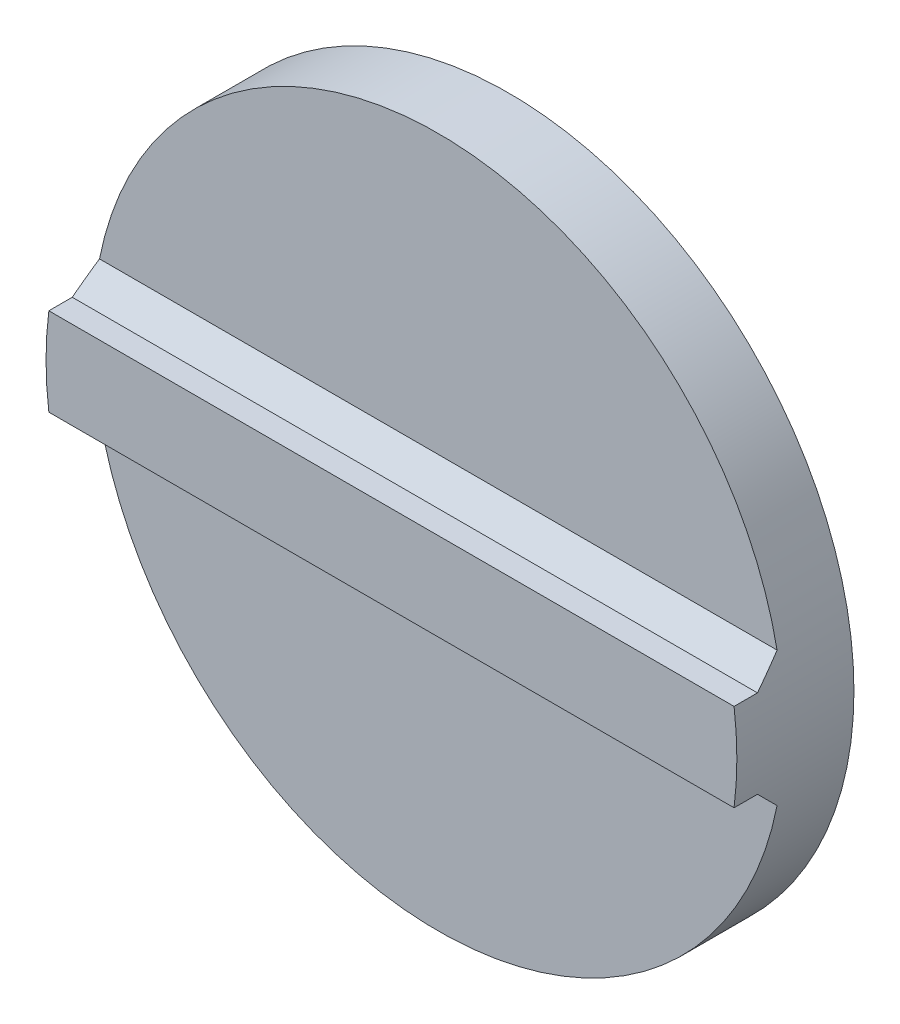
ISO-10303-21;
HEADER;
FILE_DESCRIPTION(('STEP AP214'),'2;1');
FILE_NAME('part.step','',(''),(''),'','','');
FILE_SCHEMA(('AUTOMOTIVE_DESIGN { 1 0 10303 214 1 1 1 1 }'));
ENDSEC;
DATA;
#1=APPLICATION_CONTEXT('core data for automotive mechanical design processes');
#2=APPLICATION_PROTOCOL_DEFINITION('international standard','automotive_design',2000,#1);
#3=PRODUCT_CONTEXT('',#1,'mechanical');
#4=PRODUCT('Part','Part','',(#3));
#5=PRODUCT_RELATED_PRODUCT_CATEGORY('part','',(#4));
#6=PRODUCT_DEFINITION_FORMATION('','',#4);
#7=PRODUCT_DEFINITION_CONTEXT('part definition',#1,'design');
#8=PRODUCT_DEFINITION('design','',#6,#7);
#9=PRODUCT_DEFINITION_SHAPE('','',#8);
#10=(LENGTH_UNIT() NAMED_UNIT(*) SI_UNIT(.MILLI.,.METRE.));
#11=(NAMED_UNIT(*) PLANE_ANGLE_UNIT() SI_UNIT($,.RADIAN.));
#12=(NAMED_UNIT(*) SI_UNIT($,.STERADIAN.) SOLID_ANGLE_UNIT());
#13=UNCERTAINTY_MEASURE_WITH_UNIT(LENGTH_MEASURE(1.E-05),#10,'distance_accuracy_value','');
#14=(GEOMETRIC_REPRESENTATION_CONTEXT(3) GLOBAL_UNCERTAINTY_ASSIGNED_CONTEXT((#13)) GLOBAL_UNIT_ASSIGNED_CONTEXT((#10,
#11,#12)) REPRESENTATION_CONTEXT('',''));
#15=CARTESIAN_POINT('',(0.,0.,0.));
#16=DIRECTION('',(0.,0.,1.));
#17=DIRECTION('',(1.,0.,0.));
#18=AXIS2_PLACEMENT_3D('',#15,#16,#17);
#19=CARTESIAN_POINT('',(0.,0.,1.2));
#20=DIRECTION('',(0.,0.,1.));
#21=DIRECTION('',(1.,0.,0.));
#22=AXIS2_PLACEMENT_3D('',#19,#20,#21);
#23=PLANE('',#22);
#24=CARTESIAN_POINT('',(0.,0.,1.2));
#25=DIRECTION('',(0.,0.,1.));
#26=DIRECTION('',(1.,0.,0.));
#27=AXIS2_PLACEMENT_3D('',#24,#25,#26);
#28=CIRCLE('',#27,5.9);
#29=CARTESIAN_POINT('',(-5.78683851511341,-1.15,1.2));
#30=VERTEX_POINT('',#29);
#31=CARTESIAN_POINT('',(5.78683851511341,-1.15,1.2));
#32=VERTEX_POINT('',#31);
#33=EDGE_CURVE('E132',#30,#32,#28,.T.);
#34=ORIENTED_EDGE('',*,*,#33,.T.);
#35=DIRECTION('',(-1.,0.,0.));
#36=VECTOR('',#35,1.);
#37=CARTESIAN_POINT('',(0.,-1.15,1.2));
#38=LINE('',#37,#36);
#39=EDGE_CURVE('E145',#32,#30,#38,.T.);
#40=ORIENTED_EDGE('',*,*,#39,.T.);
#41=EDGE_LOOP('',(#34,#40));
#42=FACE_BOUND('',#41,.T.);
#43=ADVANCED_FACE('F47',(#42),#23,.T.);
#44=CARTESIAN_POINT('',(0.,0.,1.2));
#45=DIRECTION('',(0.,0.,-1.));
#46=DIRECTION('',(-1.,0.,0.));
#47=AXIS2_PLACEMENT_3D('',#44,#45,#46);
#48=CYLINDRICAL_SURFACE('',#47,5.9);
#49=CARTESIAN_POINT('',(5.78683851511341,1.15,1.2));
#50=VERTEX_POINT('',#49);
#51=CARTESIAN_POINT('',(-5.78683851511341,1.15,1.2));
#52=VERTEX_POINT('',#51);
#53=EDGE_CURVE('E138',#50,#52,#28,.T.);
#54=ORIENTED_EDGE('',*,*,#53,.F.);
#55=CARTESIAN_POINT('',(0.,0.,2.35000000000001));
#56=DIRECTION('',(0.,-0.707106781186549,-0.707106781186546));
#57=DIRECTION('',(0.,0.707106781186546,-0.707106781186549));
#58=AXIS2_PLACEMENT_3D('',#55,#56,#57);
#59=ELLIPSE('',#58,8.34386001800128,5.9);
#60=CARTESIAN_POINT('',(5.85213636204762,0.750000000000005,1.6));
#61=VERTEX_POINT('',#60);
#62=EDGE_CURVE('E11',#50,#61,#59,.T.);
#63=ORIENTED_EDGE('',*,*,#62,.T.);
#64=DIRECTION('',(0.,0.,-1.));
#65=VECTOR('',#64,1.);
#66=CARTESIAN_POINT('',(5.85213636204762,0.750000000000005,2.));
#67=LINE('',#66,#65);
#68=CARTESIAN_POINT('',(5.85213636204762,0.750000000000005,2.));
#69=VERTEX_POINT('',#68);
#70=EDGE_CURVE('E105',#69,#61,#67,.T.);
#71=ORIENTED_EDGE('',*,*,#70,.F.);
#72=CARTESIAN_POINT('',(0.,0.,2.));
#73=DIRECTION('',(0.,0.,1.));
#74=DIRECTION('',(1.,0.,0.));
#75=AXIS2_PLACEMENT_3D('',#72,#73,#74);
#76=CIRCLE('',#75,5.9);
#77=CARTESIAN_POINT('',(5.85213636204763,-0.750000000000002,2.));
#78=VERTEX_POINT('',#77);
#79=EDGE_CURVE('E112',#78,#69,#76,.T.);
#80=ORIENTED_EDGE('',*,*,#79,.F.);
#81=DIRECTION('',(0.,0.,-1.));
#82=VECTOR('',#81,1.);
#83=CARTESIAN_POINT('',(5.85213636204763,-0.750000000000002,2.));
#84=LINE('',#83,#82);
#85=CARTESIAN_POINT('',(5.85213636204763,-0.750000000000002,1.6));
#86=VERTEX_POINT('',#85);
#87=EDGE_CURVE('E173',#78,#86,#84,.T.);
#88=ORIENTED_EDGE('',*,*,#87,.T.);
#89=CARTESIAN_POINT('',(0.,0.,2.35000000000001));
#90=DIRECTION('',(0.,0.707106781186549,-0.707106781186546));
#91=DIRECTION('',(0.,-0.707106781186546,-0.707106781186549));
#92=AXIS2_PLACEMENT_3D('',#89,#90,#91);
#93=ELLIPSE('',#92,8.34386001800128,5.9);
#94=EDGE_CURVE('E153',#86,#32,#93,.T.);
#95=ORIENTED_EDGE('',*,*,#94,.T.);
#96=ORIENTED_EDGE('',*,*,#33,.F.);
#97=CARTESIAN_POINT('',(0.,0.,2.35000000000001));
#98=DIRECTION('',(0.,0.707106781186549,-0.707106781186546));
#99=DIRECTION('',(0.,-0.707106781186546,-0.707106781186549));
#100=AXIS2_PLACEMENT_3D('',#97,#98,#99);
#101=ELLIPSE('',#100,8.34386001800128,5.9);
#102=CARTESIAN_POINT('',(-5.85213636204763,-0.750000000000002,1.6));
#103=VERTEX_POINT('',#102);
#104=EDGE_CURVE('E156',#30,#103,#101,.T.);
#105=ORIENTED_EDGE('',*,*,#104,.T.);
#106=DIRECTION('',(0.,0.,-1.));
#107=VECTOR('',#106,1.);
#108=CARTESIAN_POINT('',(-5.85213636204763,-0.750000000000002,2.));
#109=LINE('',#108,#107);
#110=CARTESIAN_POINT('',(-5.85213636204763,-0.750000000000002,2.));
#111=VERTEX_POINT('',#110);
#112=EDGE_CURVE('E134',#111,#103,#109,.T.);
#113=ORIENTED_EDGE('',*,*,#112,.F.);
#114=CARTESIAN_POINT('',(0.,0.,2.));
#115=DIRECTION('',(0.,0.,1.));
#116=DIRECTION('',(1.,0.,0.));
#117=AXIS2_PLACEMENT_3D('',#114,#115,#116);
#118=CIRCLE('',#117,5.9);
#119=CARTESIAN_POINT('',(-5.85213636204763,0.749999999999998,2.));
#120=VERTEX_POINT('',#119);
#121=EDGE_CURVE('E111',#120,#111,#118,.T.);
#122=ORIENTED_EDGE('',*,*,#121,.F.);
#123=DIRECTION('',(0.,0.,-1.));
#124=VECTOR('',#123,1.);
#125=CARTESIAN_POINT('',(-5.85213636204763,0.749999999999998,2.));
#126=LINE('',#125,#124);
#127=CARTESIAN_POINT('',(-5.85213636204763,0.749999999999998,1.6));
#128=VERTEX_POINT('',#127);
#129=EDGE_CURVE('E107',#120,#128,#126,.T.);
#130=ORIENTED_EDGE('',*,*,#129,.T.);
#131=CARTESIAN_POINT('',(0.,0.,2.35000000000001));
#132=DIRECTION('',(0.,-0.707106781186549,-0.707106781186546));
#133=DIRECTION('',(0.,0.707106781186546,-0.707106781186549));
#134=AXIS2_PLACEMENT_3D('',#131,#132,#133);
#135=ELLIPSE('',#134,8.34386001800128,5.9);
#136=EDGE_CURVE('E57',#128,#52,#135,.T.);
#137=ORIENTED_EDGE('',*,*,#136,.T.);
#138=EDGE_LOOP('',(#54,#63,#71,#80,#88,#95,#96,#105,#113,#122,#130,#137));
#139=FACE_BOUND('',#138,.T.);
#140=CARTESIAN_POINT('',(0.,0.,0.));
#141=DIRECTION('',(0.,0.,1.));
#142=DIRECTION('',(1.,0.,0.));
#143=AXIS2_PLACEMENT_3D('',#140,#141,#142);
#144=CIRCLE('',#143,5.9);
#145=CARTESIAN_POINT('',(5.9,0.,0.));
#146=VERTEX_POINT('',#145);
#147=EDGE_CURVE('E127',#146,#146,#144,.T.);
#148=ORIENTED_EDGE('',*,*,#147,.T.);
#149=EDGE_LOOP('',(#148));
#150=FACE_BOUND('',#149,.T.);
#151=ADVANCED_FACE('F123',(#139,#150),#48,.T.);
#152=ORIENTED_EDGE('',*,*,#53,.T.);
#153=DIRECTION('',(1.,0.,0.));
#154=VECTOR('',#153,1.);
#155=CARTESIAN_POINT('',(0.,1.15,1.2));
#156=LINE('',#155,#154);
#157=EDGE_CURVE('E69',#52,#50,#156,.T.);
#158=ORIENTED_EDGE('',*,*,#157,.T.);
#159=EDGE_LOOP('',(#152,#158));
#160=FACE_BOUND('',#159,.T.);
#161=ADVANCED_FACE('F200',(#160),#23,.T.);
#162=CARTESIAN_POINT('',(0.,0.,0.));
#163=DIRECTION('',(0.,0.,1.));
#164=DIRECTION('',(1.,0.,0.));
#165=AXIS2_PLACEMENT_3D('',#162,#163,#164);
#166=PLANE('',#165);
#167=CARTESIAN_POINT('',(0.,0.,0.));
#168=DIRECTION('',(0.,0.,-1.));
#169=DIRECTION('',(-1.,0.,0.));
#170=AXIS2_PLACEMENT_3D('',#167,#168,#169);
#171=CIRCLE('',#170,1.5);
#172=CARTESIAN_POINT('',(-1.5,0.,0.));
#173=VERTEX_POINT('',#172);
#174=EDGE_CURVE('E181',#173,#173,#171,.T.);
#175=ORIENTED_EDGE('',*,*,#174,.F.);
#176=EDGE_LOOP('',(#175));
#177=FACE_BOUND('',#176,.T.);
#178=ORIENTED_EDGE('',*,*,#147,.F.);
#179=EDGE_LOOP('',(#178));
#180=FACE_BOUND('',#179,.T.);
#181=ADVANCED_FACE('F197',(#177,#180),#166,.F.);
#182=CARTESIAN_POINT('',(-5.85213636204763,0.749999999999998,2.));
#183=DIRECTION('',(0.,-1.,0.));
#184=DIRECTION('',(1.,0.,0.));
#185=AXIS2_PLACEMENT_3D('',#182,#183,#184);
#186=PLANE('',#185);
#187=ORIENTED_EDGE('',*,*,#70,.T.);
#188=DIRECTION('',(-1.,0.,0.));
#189=VECTOR('',#188,1.);
#190=CARTESIAN_POINT('',(-5.85213636204763,0.749999999999998,1.6));
#191=LINE('',#190,#189);
#192=EDGE_CURVE('E148',#61,#128,#191,.T.);
#193=ORIENTED_EDGE('',*,*,#192,.T.);
#194=ORIENTED_EDGE('',*,*,#129,.F.);
#195=DIRECTION('',(-1.,0.,0.));
#196=VECTOR('',#195,1.);
#197=CARTESIAN_POINT('',(-5.85213636204763,0.749999999999998,2.));
#198=LINE('',#197,#196);
#199=EDGE_CURVE('E100',#69,#120,#198,.T.);
#200=ORIENTED_EDGE('',*,*,#199,.F.);
#201=EDGE_LOOP('',(#187,#193,#194,#200));
#202=FACE_BOUND('',#201,.T.);
#203=ADVANCED_FACE('F102',(#202),#186,.F.);
#204=CARTESIAN_POINT('',(-5.85213636204763,-0.750000000000002,2.));
#205=DIRECTION('',(0.,1.,0.));
#206=DIRECTION('',(0.,0.,1.));
#207=AXIS2_PLACEMENT_3D('',#204,#205,#206);
#208=PLANE('',#207);
#209=ORIENTED_EDGE('',*,*,#112,.T.);
#210=DIRECTION('',(1.,0.,0.));
#211=VECTOR('',#210,1.);
#212=CARTESIAN_POINT('',(-5.85213636204763,-0.750000000000002,1.6));
#213=LINE('',#212,#211);
#214=EDGE_CURVE('E140',#103,#86,#213,.T.);
#215=ORIENTED_EDGE('',*,*,#214,.T.);
#216=ORIENTED_EDGE('',*,*,#87,.F.);
#217=DIRECTION('',(1.,0.,0.));
#218=VECTOR('',#217,1.);
#219=CARTESIAN_POINT('',(-5.85213636204763,-0.750000000000002,2.));
#220=LINE('',#219,#218);
#221=EDGE_CURVE('E117',#111,#78,#220,.T.);
#222=ORIENTED_EDGE('',*,*,#221,.F.);
#223=EDGE_LOOP('',(#209,#215,#216,#222));
#224=FACE_BOUND('',#223,.T.);
#225=ADVANCED_FACE('F171',(#224),#208,.F.);
#226=CARTESIAN_POINT('',(0.,0.,2.));
#227=DIRECTION('',(0.,0.,1.));
#228=DIRECTION('',(1.,0.,0.));
#229=AXIS2_PLACEMENT_3D('',#226,#227,#228);
#230=PLANE('',#229);
#231=ORIENTED_EDGE('',*,*,#79,.T.);
#232=ORIENTED_EDGE('',*,*,#199,.T.);
#233=ORIENTED_EDGE('',*,*,#121,.T.);
#234=ORIENTED_EDGE('',*,*,#221,.T.);
#235=EDGE_LOOP('',(#231,#232,#233,#234));
#236=FACE_BOUND('',#235,.T.);
#237=ADVANCED_FACE('F115',(#236),#230,.T.);
#238=CARTESIAN_POINT('',(-5.85213636204763,-0.750000000000002,1.6));
#239=DIRECTION('',(0.,0.707106781186549,-0.707106781186546));
#240=DIRECTION('',(1.,0.,0.));
#241=AXIS2_PLACEMENT_3D('',#238,#239,#240);
#242=PLANE('',#241);
#243=ORIENTED_EDGE('',*,*,#104,.F.);
#244=ORIENTED_EDGE('',*,*,#39,.F.);
#245=ORIENTED_EDGE('',*,*,#94,.F.);
#246=ORIENTED_EDGE('',*,*,#214,.F.);
#247=EDGE_LOOP('',(#243,#244,#245,#246));
#248=FACE_BOUND('',#247,.T.);
#249=ADVANCED_FACE('F166',(#248),#242,.F.);
#250=CARTESIAN_POINT('',(-5.85213636204763,0.749999999999998,1.6));
#251=DIRECTION('',(0.,-0.707106781186549,-0.707106781186546));
#252=DIRECTION('',(-1.,0.,0.));
#253=AXIS2_PLACEMENT_3D('',#250,#251,#252);
#254=PLANE('',#253);
#255=ORIENTED_EDGE('',*,*,#62,.F.);
#256=ORIENTED_EDGE('',*,*,#157,.F.);
#257=ORIENTED_EDGE('',*,*,#136,.F.);
#258=ORIENTED_EDGE('',*,*,#192,.F.);
#259=EDGE_LOOP('',(#255,#256,#257,#258));
#260=FACE_BOUND('',#259,.T.);
#261=ADVANCED_FACE('F50',(#260),#254,.F.);
#262=CARTESIAN_POINT('',(0.,0.,0.5));
#263=DIRECTION('',(0.,0.,-1.));
#264=DIRECTION('',(-1.,0.,0.));
#265=AXIS2_PLACEMENT_3D('',#262,#263,#264);
#266=CYLINDRICAL_SURFACE('',#265,1.5);
#267=CARTESIAN_POINT('',(0.,0.,0.5));
#268=DIRECTION('',(0.,0.,-1.));
#269=DIRECTION('',(-1.,0.,0.));
#270=AXIS2_PLACEMENT_3D('',#267,#268,#269);
#271=CIRCLE('',#270,1.5);
#272=CARTESIAN_POINT('',(-1.5,0.,0.5));
#273=VERTEX_POINT('',#272);
#274=EDGE_CURVE('E121',#273,#273,#271,.T.);
#275=ORIENTED_EDGE('',*,*,#274,.F.);
#276=EDGE_LOOP('',(#275));
#277=FACE_BOUND('',#276,.T.);
#278=ORIENTED_EDGE('',*,*,#174,.T.);
#279=EDGE_LOOP('',(#278));
#280=FACE_BOUND('',#279,.T.);
#281=ADVANCED_FACE('F191',(#277,#280),#266,.F.);
#282=CARTESIAN_POINT('',(0.,0.,0.5));
#283=DIRECTION('',(0.,0.,-1.));
#284=DIRECTION('',(-1.,0.,0.));
#285=AXIS2_PLACEMENT_3D('',#282,#283,#284);
#286=PLANE('',#285);
#287=ORIENTED_EDGE('',*,*,#274,.T.);
#288=EDGE_LOOP('',(#287));
#289=FACE_BOUND('',#288,.T.);
#290=ADVANCED_FACE('F189',(#289),#286,.T.);
#291=CLOSED_SHELL('',(#43,#151,#161,#181,#203,#225,#237,#249,#261,#281,#290));
#292=MANIFOLD_SOLID_BREP('B2',#291);
#293=ADVANCED_BREP_SHAPE_REPRESENTATION('',(#18,#292),#14);
#294=SHAPE_DEFINITION_REPRESENTATION(#9,#293);
ENDSEC;
END-ISO-10303-21;
